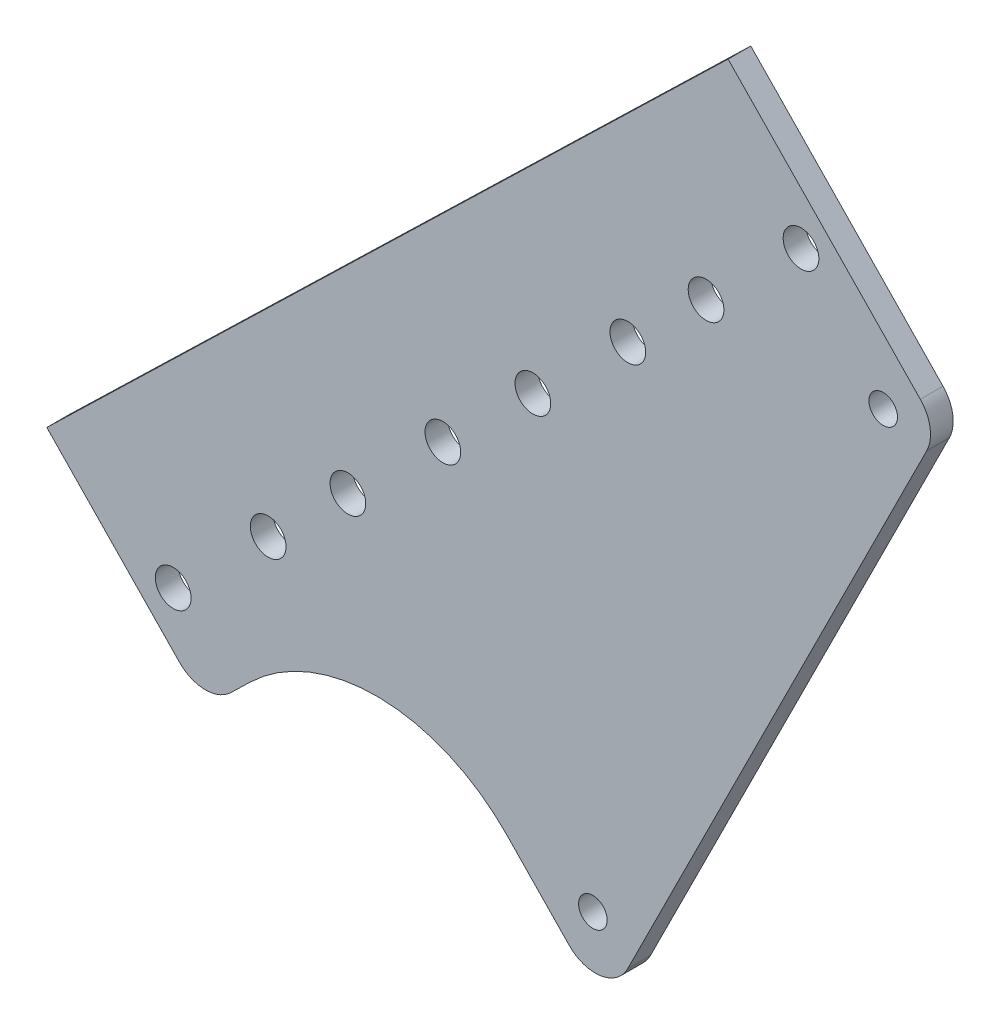
ISO-10303-21;
HEADER;
FILE_DESCRIPTION(('STEP AP214'),'2;1');
FILE_NAME('part.step','',(''),(''),'','','');
FILE_SCHEMA(('AUTOMOTIVE_DESIGN { 1 0 10303 214 1 1 1 1 }'));
ENDSEC;
DATA;
#1=APPLICATION_CONTEXT('core data for automotive mechanical design processes');
#2=APPLICATION_PROTOCOL_DEFINITION('international standard','automotive_design',2000,#1);
#3=PRODUCT_CONTEXT('',#1,'mechanical');
#4=PRODUCT('Part','Part','',(#3));
#5=PRODUCT_RELATED_PRODUCT_CATEGORY('part','',(#4));
#6=PRODUCT_DEFINITION_FORMATION('','',#4);
#7=PRODUCT_DEFINITION_CONTEXT('part definition',#1,'design');
#8=PRODUCT_DEFINITION('design','',#6,#7);
#9=PRODUCT_DEFINITION_SHAPE('','',#8);
#10=(LENGTH_UNIT() NAMED_UNIT(*) SI_UNIT(.MILLI.,.METRE.));
#11=(NAMED_UNIT(*) PLANE_ANGLE_UNIT() SI_UNIT($,.RADIAN.));
#12=(NAMED_UNIT(*) SI_UNIT($,.STERADIAN.) SOLID_ANGLE_UNIT());
#13=UNCERTAINTY_MEASURE_WITH_UNIT(LENGTH_MEASURE(1.E-05),#10,'distance_accuracy_value','');
#14=(GEOMETRIC_REPRESENTATION_CONTEXT(3) GLOBAL_UNCERTAINTY_ASSIGNED_CONTEXT((#13)) GLOBAL_UNIT_ASSIGNED_CONTEXT((#10,
#11,#12)) REPRESENTATION_CONTEXT('',''));
#15=CARTESIAN_POINT('',(0.,0.,0.));
#16=DIRECTION('',(0.,0.,1.));
#17=DIRECTION('',(1.,0.,0.));
#18=AXIS2_PLACEMENT_3D('',#15,#16,#17);
#19=CARTESIAN_POINT('',(-43.0883873371505,21.5441936685753,3.175));
#20=DIRECTION('',(0.894427190999916,-0.447213595499958,0.));
#21=DIRECTION('',(0.447213595499958,0.894427190999916,0.));
#22=AXIS2_PLACEMENT_3D('',#19,#20,#21);
#23=PLANE('',#22);
#24=DIRECTION('',(-0.447213595499958,-0.894427190999916,0.));
#25=VECTOR('',#24,1.);
#26=CARTESIAN_POINT('',(-43.0883873371505,21.5441936685753,0.));
#27=LINE('',#26,#25);
#28=CARTESIAN_POINT('',(-14.2379406923614,79.2450869581535,0.));
#29=VERTEX_POINT('',#28);
#30=CARTESIAN_POINT('',(-56.0819345836657,-4.44290082445517,0.));
#31=VERTEX_POINT('',#30);
#32=EDGE_CURVE('E196',#29,#31,#27,.T.);
#33=ORIENTED_EDGE('',*,*,#32,.F.);
#34=DIRECTION('',(0.,0.,-1.));
#35=VECTOR('',#34,1.);
#36=CARTESIAN_POINT('',(-14.2379406923614,79.2450869581535,3.175));
#37=LINE('',#36,#35);
#38=CARTESIAN_POINT('',(-14.2379406923614,79.2450869581535,3.175));
#39=VERTEX_POINT('',#38);
#40=EDGE_CURVE('E213',#29,#39,#37,.F.);
#41=ORIENTED_EDGE('',*,*,#40,.T.);
#42=DIRECTION('',(-0.447213595499958,-0.894427190999916,0.));
#43=VECTOR('',#42,1.);
#44=CARTESIAN_POINT('',(-43.0883873371505,21.5441936685753,3.175));
#45=LINE('',#44,#43);
#46=CARTESIAN_POINT('',(-56.0819345836657,-4.44290082445517,3.175));
#47=VERTEX_POINT('',#46);
#48=EDGE_CURVE('E181',#39,#47,#45,.T.);
#49=ORIENTED_EDGE('',*,*,#48,.T.);
#50=DIRECTION('',(0.,0.,-1.));
#51=VECTOR('',#50,1.);
#52=CARTESIAN_POINT('',(-56.0819345836657,-4.44290082445517,0.));
#53=LINE('',#52,#51);
#54=EDGE_CURVE('E210',#47,#31,#53,.T.);
#55=ORIENTED_EDGE('',*,*,#54,.T.);
#56=EDGE_LOOP('',(#33,#41,#49,#55));
#57=FACE_BOUND('',#56,.T.);
#58=ADVANCED_FACE('F39',(#57),#23,.T.);
#59=CARTESIAN_POINT('',(34.6932664146584,33.59227819075,3.175));
#60=DIRECTION('',(0.718414301247998,0.695615476942794,0.));
#61=DIRECTION('',(-0.695615476942794,0.718414301247998,0.));
#62=AXIS2_PLACEMENT_3D('',#59,#60,#61);
#63=PLANE('',#62);
#64=DIRECTION('',(0.695615476942794,-0.718414301247998,0.));
#65=VECTOR('',#64,1.);
#66=CARTESIAN_POINT('',(34.6932664146584,33.59227819075,3.175));
#67=LINE('',#66,#65);
#68=CARTESIAN_POINT('',(-42.0319292043812,112.832145079596,3.175));
#69=VERTEX_POINT('',#68);
#70=CARTESIAN_POINT('',(-15.1320861723012,85.0506586461627,3.175));
#71=VERTEX_POINT('',#70);
#72=EDGE_CURVE('E184',#69,#71,#67,.T.);
#73=ORIENTED_EDGE('',*,*,#72,.T.);
#74=DIRECTION('',(0.,0.,-1.));
#75=VECTOR('',#74,1.);
#76=CARTESIAN_POINT('',(-15.1320861723012,85.0506586461627,3.175));
#77=LINE('',#76,#75);
#78=CARTESIAN_POINT('',(-15.1320861723012,85.0506586461627,0.));
#79=VERTEX_POINT('',#78);
#80=EDGE_CURVE('E202',#71,#79,#77,.T.);
#81=ORIENTED_EDGE('',*,*,#80,.T.);
#82=DIRECTION('',(0.695615476942794,-0.718414301247998,0.));
#83=VECTOR('',#82,1.);
#84=CARTESIAN_POINT('',(34.6932664146584,33.59227819075,0.));
#85=LINE('',#84,#83);
#86=CARTESIAN_POINT('',(-42.0319292043812,112.832145079596,0.));
#87=VERTEX_POINT('',#86);
#88=EDGE_CURVE('E129',#87,#79,#85,.T.);
#89=ORIENTED_EDGE('',*,*,#88,.F.);
#90=DIRECTION('',(0.,0.,-1.));
#91=VECTOR('',#90,1.);
#92=CARTESIAN_POINT('',(-42.0319292043812,112.832145079596,3.175));
#93=LINE('',#92,#91);
#94=EDGE_CURVE('E127',#69,#87,#93,.T.);
#95=ORIENTED_EDGE('',*,*,#94,.F.);
#96=EDGE_LOOP('',(#73,#81,#89,#95));
#97=FACE_BOUND('',#96,.T.);
#98=ADVANCED_FACE('F296',(#97),#63,.T.);
#99=CARTESIAN_POINT('',(-76.7251956190396,79.2398668888462,3.175));
#100=DIRECTION('',(0.695615476942794,-0.718414301247998,0.));
#101=DIRECTION('',(0.718414301247998,0.695615476942794,0.));
#102=AXIS2_PLACEMENT_3D('',#99,#100,#101);
#103=PLANE('',#102);
#104=DIRECTION('',(-0.718414301247998,-0.695615476942794,0.));
#105=VECTOR('',#104,1.);
#106=CARTESIAN_POINT('',(-76.7251956190396,79.2398668888462,0.));
#107=LINE('',#106,#105);
#108=CARTESIAN_POINT('',(-137.384173659925,20.5058969950491,0.));
#109=VERTEX_POINT('',#108);
#110=EDGE_CURVE('E116',#87,#109,#107,.T.);
#111=ORIENTED_EDGE('',*,*,#110,.T.);
#112=DIRECTION('',(0.,0.,-1.));
#113=VECTOR('',#112,1.);
#114=CARTESIAN_POINT('',(-137.384173659925,20.5058969950491,69.2064304654857));
#115=LINE('',#114,#113);
#116=CARTESIAN_POINT('',(-137.384173659925,20.5058969950491,3.175));
#117=VERTEX_POINT('',#116);
#118=EDGE_CURVE('E126',#117,#109,#115,.T.);
#119=ORIENTED_EDGE('',*,*,#118,.F.);
#120=DIRECTION('',(-0.718414301247998,-0.695615476942794,0.));
#121=VECTOR('',#120,1.);
#122=CARTESIAN_POINT('',(-76.7251956190396,79.2398668888462,3.175));
#123=LINE('',#122,#121);
#124=EDGE_CURVE('E187',#69,#117,#123,.T.);
#125=ORIENTED_EDGE('',*,*,#124,.F.);
#126=ORIENTED_EDGE('',*,*,#94,.T.);
#127=EDGE_LOOP('',(#111,#119,#125,#126));
#128=FACE_BOUND('',#127,.T.);
#129=ADVANCED_FACE('F124',(#128),#103,.F.);
#130=CARTESIAN_POINT('',(-60.96,0.,3.175));
#131=DIRECTION('',(0.,0.,-1.));
#132=DIRECTION('',(-1.,0.,0.));
#133=AXIS2_PLACEMENT_3D('',#130,#131,#132);
#134=CYLINDRICAL_SURFACE('',#133,2.);
#135=CARTESIAN_POINT('',(-60.96,0.,3.175));
#136=DIRECTION('',(0.,0.,1.));
#137=DIRECTION('',(1.,0.,0.));
#138=AXIS2_PLACEMENT_3D('',#135,#136,#137);
#139=CIRCLE('',#138,2.);
#140=CARTESIAN_POINT('',(-58.96,0.,3.175));
#141=VERTEX_POINT('',#140);
#142=EDGE_CURVE('E178',#141,#141,#139,.T.);
#143=ORIENTED_EDGE('',*,*,#142,.T.);
#144=EDGE_LOOP('',(#143));
#145=FACE_BOUND('',#144,.T.);
#146=CARTESIAN_POINT('',(-60.96,0.,0.));
#147=DIRECTION('',(0.,0.,1.));
#148=DIRECTION('',(1.,0.,0.));
#149=AXIS2_PLACEMENT_3D('',#146,#147,#148);
#150=CIRCLE('',#149,2.);
#151=CARTESIAN_POINT('',(-58.96,0.,0.));
#152=VERTEX_POINT('',#151);
#153=EDGE_CURVE('E193',#152,#152,#150,.T.);
#154=ORIENTED_EDGE('',*,*,#153,.F.);
#155=EDGE_LOOP('',(#154));
#156=FACE_BOUND('',#155,.T.);
#157=ADVANCED_FACE('F284',(#145,#156),#134,.F.);
#158=CARTESIAN_POINT('',(-20.32,81.28,3.175));
#159=DIRECTION('',(0.,0.,-1.));
#160=DIRECTION('',(-1.,0.,0.));
#161=AXIS2_PLACEMENT_3D('',#158,#159,#160);
#162=CYLINDRICAL_SURFACE('',#161,2.);
#163=CARTESIAN_POINT('',(-20.32,81.28,3.175));
#164=DIRECTION('',(0.,0.,1.));
#165=DIRECTION('',(1.,0.,0.));
#166=AXIS2_PLACEMENT_3D('',#163,#164,#165);
#167=CIRCLE('',#166,2.);
#168=CARTESIAN_POINT('',(-18.32,81.28,3.175));
#169=VERTEX_POINT('',#168);
#170=EDGE_CURVE('E175',#169,#169,#167,.T.);
#171=ORIENTED_EDGE('',*,*,#170,.T.);
#172=EDGE_LOOP('',(#171));
#173=FACE_BOUND('',#172,.T.);
#174=CARTESIAN_POINT('',(-20.32,81.28,0.));
#175=DIRECTION('',(0.,0.,1.));
#176=DIRECTION('',(1.,0.,0.));
#177=AXIS2_PLACEMENT_3D('',#174,#175,#176);
#178=CIRCLE('',#177,2.);
#179=CARTESIAN_POINT('',(-18.32,81.28,0.));
#180=VERTEX_POINT('',#179);
#181=EDGE_CURVE('E145',#180,#180,#178,.T.);
#182=ORIENTED_EDGE('',*,*,#181,.F.);
#183=EDGE_LOOP('',(#182));
#184=FACE_BOUND('',#183,.T.);
#185=ADVANCED_FACE('F286',(#173,#184),#162,.F.);
#186=CARTESIAN_POINT('',(-36.0245516510919,-34.8813151894287,3.175));
#187=DIRECTION('',(0.718414301247998,0.695615476942794,0.));
#188=DIRECTION('',(-0.695615476942794,0.718414301247998,0.));
#189=AXIS2_PLACEMENT_3D('',#186,#187,#188);
#190=PLANE('',#189);
#191=DIRECTION('',(0.695615476942794,-0.718414301247998,0.));
#192=VECTOR('',#191,1.);
#193=CARTESIAN_POINT('',(-36.0245516510919,-34.8813151894287,3.175));
#194=LINE('',#193,#192);
#195=CARTESIAN_POINT('',(-72.9953227628507,3.3011743830944,3.175));
#196=VERTEX_POINT('',#195);
#197=CARTESIAN_POINT('',(-64.2751693642851,-5.70478238218476,3.175));
#198=VERTEX_POINT('',#197);
#199=EDGE_CURVE('E189',#196,#198,#194,.T.);
#200=ORIENTED_EDGE('',*,*,#199,.F.);
#201=DIRECTION('',(0.,0.,-1.));
#202=VECTOR('',#201,1.);
#203=CARTESIAN_POINT('',(-72.9953227628507,3.30117438309439,3.175));
#204=LINE('',#203,#202);
#205=CARTESIAN_POINT('',(-72.9953227628507,3.3011743830944,0.));
#206=VERTEX_POINT('',#205);
#207=EDGE_CURVE('E222',#196,#206,#204,.T.);
#208=ORIENTED_EDGE('',*,*,#207,.T.);
#209=DIRECTION('',(0.695615476942794,-0.718414301247998,0.));
#210=VECTOR('',#209,1.);
#211=CARTESIAN_POINT('',(-36.0245516510919,-34.8813151894287,0.));
#212=LINE('',#211,#210);
#213=CARTESIAN_POINT('',(-64.2751693642851,-5.70478238218476,0.));
#214=VERTEX_POINT('',#213);
#215=EDGE_CURVE('E128',#206,#214,#212,.T.);
#216=ORIENTED_EDGE('',*,*,#215,.T.);
#217=DIRECTION('',(0.,0.,-1.));
#218=VECTOR('',#217,1.);
#219=CARTESIAN_POINT('',(-64.2751693642851,-5.70478238218477,3.175));
#220=LINE('',#219,#218);
#221=EDGE_CURVE('E219',#214,#198,#220,.F.);
#222=ORIENTED_EDGE('',*,*,#221,.T.);
#223=EDGE_LOOP('',(#200,#208,#216,#222));
#224=FACE_BOUND('',#223,.T.);
#225=ADVANCED_FACE('F293',(#224),#190,.F.);
#226=CARTESIAN_POINT('',(0.,0.,3.175));
#227=DIRECTION('',(0.,0.,1.));
#228=DIRECTION('',(1.,0.,0.));
#229=AXIS2_PLACEMENT_3D('',#226,#227,#228);
#230=PLANE('',#229);
#231=CARTESIAN_POINT('',(-106.40482690328,22.7743833916435,3.175));
#232=DIRECTION('',(0.,0.,-1.));
#233=DIRECTION('',(-1.,0.,0.));
#234=AXIS2_PLACEMENT_3D('',#231,#232,#233);
#235=CIRCLE('',#234,2.50000000000001);
#236=CARTESIAN_POINT('',(-108.90482690328,22.7743833916435,3.175));
#237=VERTEX_POINT('',#236);
#238=EDGE_CURVE('E244',#237,#237,#235,.T.);
#239=ORIENTED_EDGE('',*,*,#238,.T.);
#240=EDGE_LOOP('',(#239));
#241=FACE_BOUND('',#240,.T.);
#242=CARTESIAN_POINT('',(-119.695491476368,9.9054970682018,3.175));
#243=DIRECTION('',(0.,0.,-1.));
#244=DIRECTION('',(-1.,0.,0.));
#245=AXIS2_PLACEMENT_3D('',#242,#243,#244);
#246=CIRCLE('',#245,2.49999999999999);
#247=CARTESIAN_POINT('',(-122.195491476368,9.9054970682018,3.175));
#248=VERTEX_POINT('',#247);
#249=EDGE_CURVE('E250',#248,#248,#246,.T.);
#250=ORIENTED_EDGE('',*,*,#249,.T.);
#251=EDGE_LOOP('',(#250));
#252=FACE_BOUND('',#251,.T.);
#253=CARTESIAN_POINT('',(-95.2435423190912,33.5814654414267,3.175));
#254=DIRECTION('',(0.,0.,-1.));
#255=DIRECTION('',(-1.,0.,0.));
#256=AXIS2_PLACEMENT_3D('',#253,#254,#255);
#257=CIRCLE('',#256,2.5);
#258=CARTESIAN_POINT('',(-97.7435423190912,33.5814654414267,3.175));
#259=VERTEX_POINT('',#258);
#260=EDGE_CURVE('E142',#259,#259,#257,.T.);
#261=ORIENTED_EDGE('',*,*,#260,.T.);
#262=EDGE_LOOP('',(#261));
#263=FACE_BOUND('',#262,.T.);
#264=CARTESIAN_POINT('',(-69.354776651216,58.6486530603751,3.175));
#265=DIRECTION('',(0.,0.,-1.));
#266=DIRECTION('',(-1.,0.,0.));
#267=AXIS2_PLACEMENT_3D('',#264,#265,#266);
#268=CIRCLE('',#267,2.50000000000001);
#269=CARTESIAN_POINT('',(-71.854776651216,58.6486530603751,3.175));
#270=VERTEX_POINT('',#269);
#271=EDGE_CURVE('E134',#270,#270,#268,.T.);
#272=ORIENTED_EDGE('',*,*,#271,.T.);
#273=EDGE_LOOP('',(#272));
#274=FACE_BOUND('',#273,.T.);
#275=CARTESIAN_POINT('',(-31.8248135540206,94.9876055758667,3.175));
#276=DIRECTION('',(0.,0.,-1.));
#277=DIRECTION('',(-1.,0.,0.));
#278=AXIS2_PLACEMENT_3D('',#275,#276,#277);
#279=CIRCLE('',#278,2.5);
#280=CARTESIAN_POINT('',(-34.3248135540206,94.9876055758667,3.175));
#281=VERTEX_POINT('',#280);
#282=EDGE_CURVE('E167',#281,#281,#279,.T.);
#283=ORIENTED_EDGE('',*,*,#282,.T.);
#284=EDGE_LOOP('',(#283));
#285=FACE_BOUND('',#284,.T.);
#286=CARTESIAN_POINT('',(-81.9528777460032,46.4503517648684,3.175));
#287=DIRECTION('',(0.,0.,-1.));
#288=DIRECTION('',(-1.,0.,0.));
#289=AXIS2_PLACEMENT_3D('',#286,#287,#288);
#290=CIRCLE('',#289,2.50000000000269);
#291=CARTESIAN_POINT('',(-84.4528777460059,46.4503517648684,3.175));
#292=VERTEX_POINT('',#291);
#293=EDGE_CURVE('E156',#292,#292,#290,.T.);
#294=ORIENTED_EDGE('',*,*,#293,.T.);
#295=EDGE_LOOP('',(#294));
#296=FACE_BOUND('',#295,.T.);
#297=CARTESIAN_POINT('',(-45.1154781271085,82.118719252425,3.175));
#298=DIRECTION('',(0.,0.,-1.));
#299=DIRECTION('',(-1.,0.,0.));
#300=AXIS2_PLACEMENT_3D('',#297,#298,#299);
#301=CIRCLE('',#300,2.5000000000027);
#302=CARTESIAN_POINT('',(-47.6154781271112,82.118719252425,3.175));
#303=VERTEX_POINT('',#302);
#304=EDGE_CURVE('E157',#303,#303,#301,.T.);
#305=ORIENTED_EDGE('',*,*,#304,.T.);
#306=EDGE_LOOP('',(#305));
#307=FACE_BOUND('',#306,.T.);
#308=CARTESIAN_POINT('',(-56.064112078128,71.5175393838168,3.175));
#309=DIRECTION('',(0.,0.,-1.));
#310=DIRECTION('',(-1.,0.,0.));
#311=AXIS2_PLACEMENT_3D('',#308,#309,#310);
#312=CIRCLE('',#311,2.5000000000027);
#313=CARTESIAN_POINT('',(-58.5641120781307,71.5175393838168,3.175));
#314=VERTEX_POINT('',#313);
#315=EDGE_CURVE('E151',#314,#314,#312,.T.);
#316=ORIENTED_EDGE('',*,*,#315,.T.);
#317=EDGE_LOOP('',(#316));
#318=FACE_BOUND('',#317,.T.);
#319=ORIENTED_EDGE('',*,*,#170,.F.);
#320=EDGE_LOOP('',(#319));
#321=FACE_BOUND('',#320,.T.);
#322=ORIENTED_EDGE('',*,*,#142,.F.);
#323=EDGE_LOOP('',(#322));
#324=FACE_BOUND('',#323,.T.);
#325=DIRECTION('',(-0.695615476942794,0.718414301247998,0.));
#326=VECTOR('',#325,1.);
#327=CARTESIAN_POINT('',(-137.384173659925,20.5058969950491,3.175));
#328=LINE('',#327,#326);
#329=CARTESIAN_POINT('',(-118.832108889861,1.34578758076497,3.175));
#330=VERTEX_POINT('',#329);
#331=EDGE_CURVE('E132',#330,#117,#328,.T.);
#332=ORIENTED_EDGE('',*,*,#331,.F.);
#333=CARTESIAN_POINT('',(-115.182564239521,4.87951420363437,3.175));
#334=DIRECTION('',(0.,0.,1.));
#335=DIRECTION('',(1.,0.,0.));
#336=AXIS2_PLACEMENT_3D('',#333,#334,#335);
#337=CIRCLE('',#336,5.08);
#338=CARTESIAN_POINT('',(-111.648837616652,1.22996955329454,3.175));
#339=VERTEX_POINT('',#338);
#340=EDGE_CURVE('E11',#330,#339,#337,.T.);
#341=ORIENTED_EDGE('',*,*,#340,.T.);
#342=DIRECTION('',(-0.718414301247998,-0.695615476942794,0.));
#343=VECTOR('',#342,1.);
#344=CARTESIAN_POINT('',(-115.298382266992,-2.30375706957486,3.175));
#345=LINE('',#344,#343);
#346=CARTESIAN_POINT('',(-108.911679128897,3.88026452044659,3.175));
#347=VERTEX_POINT('',#346);
#348=EDGE_CURVE('E119',#347,#339,#345,.T.);
#349=ORIENTED_EDGE('',*,*,#348,.F.);
#350=CARTESIAN_POINT('',(-91.2430460145499,-14.3674587312526,3.175));
#351=DIRECTION('',(0.,0.,1.));
#352=DIRECTION('',(1.,0.,0.));
#353=AXIS2_PLACEMENT_3D('',#350,#351,#352);
#354=CIRCLE('',#353,25.4);
#355=EDGE_CURVE('E229',#347,#196,#354,.F.);
#356=ORIENTED_EDGE('',*,*,#355,.T.);
#357=ORIENTED_EDGE('',*,*,#199,.T.);
#358=CARTESIAN_POINT('',(-60.6256247139453,-2.17105575931538,3.175));
#359=DIRECTION('',(0.,0.,1.));
#360=DIRECTION('',(1.,0.,0.));
#361=AXIS2_PLACEMENT_3D('',#358,#359,#360);
#362=CIRCLE('',#361,5.08);
#363=EDGE_CURVE('E215',#198,#47,#362,.T.);
#364=ORIENTED_EDGE('',*,*,#363,.T.);
#365=ORIENTED_EDGE('',*,*,#48,.F.);
#366=CARTESIAN_POINT('',(-18.781630822641,81.5169320232933,3.175));
#367=DIRECTION('',(0.,0.,1.));
#368=DIRECTION('',(1.,0.,0.));
#369=AXIS2_PLACEMENT_3D('',#366,#367,#368);
#370=CIRCLE('',#369,5.08);
#371=EDGE_CURVE('E217',#39,#71,#370,.T.);
#372=ORIENTED_EDGE('',*,*,#371,.T.);
#373=ORIENTED_EDGE('',*,*,#72,.F.);
#374=ORIENTED_EDGE('',*,*,#124,.T.);
#375=EDGE_LOOP('',(#332,#341,#349,#356,#357,#364,#365,#372,#373,#374));
#376=FACE_BOUND('',#375,.T.);
#377=ADVANCED_FACE('F264',(#241,#252,#263,#274,#285,#296,#307,#318,#321,#324,#376),#230,.T.);
#378=CARTESIAN_POINT('',(0.,0.,0.));
#379=DIRECTION('',(0.,0.,1.));
#380=DIRECTION('',(1.,0.,0.));
#381=AXIS2_PLACEMENT_3D('',#378,#379,#380);
#382=PLANE('',#381);
#383=CARTESIAN_POINT('',(-106.40482690328,22.7743833916435,0.));
#384=DIRECTION('',(0.,0.,-1.));
#385=DIRECTION('',(-1.,0.,0.));
#386=AXIS2_PLACEMENT_3D('',#383,#384,#385);
#387=CIRCLE('',#386,2.50000000000001);
#388=CARTESIAN_POINT('',(-108.90482690328,22.7743833916435,0.));
#389=VERTEX_POINT('',#388);
#390=EDGE_CURVE('E247',#389,#389,#387,.T.);
#391=ORIENTED_EDGE('',*,*,#390,.F.);
#392=EDGE_LOOP('',(#391));
#393=FACE_BOUND('',#392,.T.);
#394=CARTESIAN_POINT('',(-119.695491476368,9.9054970682018,0.));
#395=DIRECTION('',(0.,0.,-1.));
#396=DIRECTION('',(-1.,0.,0.));
#397=AXIS2_PLACEMENT_3D('',#394,#395,#396);
#398=CIRCLE('',#397,2.49999999999999);
#399=CARTESIAN_POINT('',(-122.195491476368,9.9054970682018,0.));
#400=VERTEX_POINT('',#399);
#401=EDGE_CURVE('E253',#400,#400,#398,.T.);
#402=ORIENTED_EDGE('',*,*,#401,.F.);
#403=EDGE_LOOP('',(#402));
#404=FACE_BOUND('',#403,.T.);
#405=CARTESIAN_POINT('',(-95.2435423190912,33.5814654414267,0.));
#406=DIRECTION('',(0.,0.,-1.));
#407=DIRECTION('',(-1.,0.,0.));
#408=AXIS2_PLACEMENT_3D('',#405,#406,#407);
#409=CIRCLE('',#408,2.5);
#410=CARTESIAN_POINT('',(-97.7435423190912,33.5814654414267,0.));
#411=VERTEX_POINT('',#410);
#412=EDGE_CURVE('E146',#411,#411,#409,.T.);
#413=ORIENTED_EDGE('',*,*,#412,.F.);
#414=EDGE_LOOP('',(#413));
#415=FACE_BOUND('',#414,.T.);
#416=CARTESIAN_POINT('',(-69.354776651216,58.6486530603751,0.));
#417=DIRECTION('',(0.,0.,-1.));
#418=DIRECTION('',(-1.,0.,0.));
#419=AXIS2_PLACEMENT_3D('',#416,#417,#418);
#420=CIRCLE('',#419,2.50000000000001);
#421=CARTESIAN_POINT('',(-71.854776651216,58.6486530603751,0.));
#422=VERTEX_POINT('',#421);
#423=EDGE_CURVE('E137',#422,#422,#420,.T.);
#424=ORIENTED_EDGE('',*,*,#423,.F.);
#425=EDGE_LOOP('',(#424));
#426=FACE_BOUND('',#425,.T.);
#427=CARTESIAN_POINT('',(-31.8248135540206,94.9876055758667,0.));
#428=DIRECTION('',(0.,0.,-1.));
#429=DIRECTION('',(-1.,0.,0.));
#430=AXIS2_PLACEMENT_3D('',#427,#428,#429);
#431=CIRCLE('',#430,2.5);
#432=CARTESIAN_POINT('',(-34.3248135540206,94.9876055758667,0.));
#433=VERTEX_POINT('',#432);
#434=EDGE_CURVE('E149',#433,#433,#431,.T.);
#435=ORIENTED_EDGE('',*,*,#434,.F.);
#436=EDGE_LOOP('',(#435));
#437=FACE_BOUND('',#436,.T.);
#438=CARTESIAN_POINT('',(-81.9528777460032,46.4503517648684,0.));
#439=DIRECTION('',(0.,0.,-1.));
#440=DIRECTION('',(-1.,0.,0.));
#441=AXIS2_PLACEMENT_3D('',#438,#439,#440);
#442=CIRCLE('',#441,2.50000000000269);
#443=CARTESIAN_POINT('',(-84.4528777460059,46.4503517648684,0.));
#444=VERTEX_POINT('',#443);
#445=EDGE_CURVE('E170',#444,#444,#442,.T.);
#446=ORIENTED_EDGE('',*,*,#445,.F.);
#447=EDGE_LOOP('',(#446));
#448=FACE_BOUND('',#447,.T.);
#449=CARTESIAN_POINT('',(-45.1154781271085,82.118719252425,0.));
#450=DIRECTION('',(0.,0.,-1.));
#451=DIRECTION('',(-1.,0.,0.));
#452=AXIS2_PLACEMENT_3D('',#449,#450,#451);
#453=CIRCLE('',#452,2.5000000000027);
#454=CARTESIAN_POINT('',(-47.6154781271112,82.118719252425,0.));
#455=VERTEX_POINT('',#454);
#456=EDGE_CURVE('E153',#455,#455,#453,.T.);
#457=ORIENTED_EDGE('',*,*,#456,.F.);
#458=EDGE_LOOP('',(#457));
#459=FACE_BOUND('',#458,.T.);
#460=CARTESIAN_POINT('',(-56.064112078128,71.5175393838168,0.));
#461=DIRECTION('',(0.,0.,-1.));
#462=DIRECTION('',(-1.,0.,0.));
#463=AXIS2_PLACEMENT_3D('',#460,#461,#462);
#464=CIRCLE('',#463,2.5000000000027);
#465=CARTESIAN_POINT('',(-58.5641120781307,71.5175393838168,0.));
#466=VERTEX_POINT('',#465);
#467=EDGE_CURVE('E160',#466,#466,#464,.T.);
#468=ORIENTED_EDGE('',*,*,#467,.F.);
#469=EDGE_LOOP('',(#468));
#470=FACE_BOUND('',#469,.T.);
#471=ORIENTED_EDGE('',*,*,#181,.T.);
#472=EDGE_LOOP('',(#471));
#473=FACE_BOUND('',#472,.T.);
#474=ORIENTED_EDGE('',*,*,#153,.T.);
#475=EDGE_LOOP('',(#474));
#476=FACE_BOUND('',#475,.T.);
#477=DIRECTION('',(-0.718414301247998,-0.695615476942794,0.));
#478=VECTOR('',#477,1.);
#479=CARTESIAN_POINT('',(-115.298382266992,-2.30375706957486,0.));
#480=LINE('',#479,#478);
#481=CARTESIAN_POINT('',(-108.911679128897,3.88026452044659,0.));
#482=VERTEX_POINT('',#481);
#483=CARTESIAN_POINT('',(-111.648837616652,1.22996955329454,0.));
#484=VERTEX_POINT('',#483);
#485=EDGE_CURVE('E120',#482,#484,#480,.T.);
#486=ORIENTED_EDGE('',*,*,#485,.T.);
#487=CARTESIAN_POINT('',(-115.182564239521,4.87951420363437,0.));
#488=DIRECTION('',(0.,0.,1.));
#489=DIRECTION('',(1.,0.,0.));
#490=AXIS2_PLACEMENT_3D('',#487,#488,#489);
#491=CIRCLE('',#490,5.08);
#492=CARTESIAN_POINT('',(-118.832108889861,1.34578758076497,0.));
#493=VERTEX_POINT('',#492);
#494=EDGE_CURVE('E61',#484,#493,#491,.F.);
#495=ORIENTED_EDGE('',*,*,#494,.T.);
#496=DIRECTION('',(-0.695615476942794,0.718414301247998,0.));
#497=VECTOR('',#496,1.);
#498=CARTESIAN_POINT('',(-137.384173659925,20.5058969950491,0.));
#499=LINE('',#498,#497);
#500=EDGE_CURVE('E112',#493,#109,#499,.T.);
#501=ORIENTED_EDGE('',*,*,#500,.T.);
#502=ORIENTED_EDGE('',*,*,#110,.F.);
#503=ORIENTED_EDGE('',*,*,#88,.T.);
#504=CARTESIAN_POINT('',(-18.781630822641,81.5169320232933,0.));
#505=DIRECTION('',(0.,0.,1.));
#506=DIRECTION('',(1.,0.,0.));
#507=AXIS2_PLACEMENT_3D('',#504,#505,#506);
#508=CIRCLE('',#507,5.08);
#509=EDGE_CURVE('E208',#79,#29,#508,.F.);
#510=ORIENTED_EDGE('',*,*,#509,.T.);
#511=ORIENTED_EDGE('',*,*,#32,.T.);
#512=CARTESIAN_POINT('',(-60.6256247139453,-2.17105575931538,0.));
#513=DIRECTION('',(0.,0.,1.));
#514=DIRECTION('',(1.,0.,0.));
#515=AXIS2_PLACEMENT_3D('',#512,#513,#514);
#516=CIRCLE('',#515,5.08);
#517=EDGE_CURVE('E205',#31,#214,#516,.F.);
#518=ORIENTED_EDGE('',*,*,#517,.T.);
#519=ORIENTED_EDGE('',*,*,#215,.F.);
#520=CARTESIAN_POINT('',(-91.2430460145499,-14.3674587312526,0.));
#521=DIRECTION('',(0.,0.,1.));
#522=DIRECTION('',(1.,0.,0.));
#523=AXIS2_PLACEMENT_3D('',#520,#521,#522);
#524=CIRCLE('',#523,25.4);
#525=EDGE_CURVE('E227',#206,#482,#524,.T.);
#526=ORIENTED_EDGE('',*,*,#525,.T.);
#527=EDGE_LOOP('',(#486,#495,#501,#502,#503,#510,#511,#518,#519,#526));
#528=FACE_BOUND('',#527,.T.);
#529=ADVANCED_FACE('F114',(#393,#404,#415,#426,#437,#448,#459,#470,#473,#476,#528),#382,.F.);
#530=CARTESIAN_POINT('',(-56.064112078128,71.5175393838168,3.175));
#531=DIRECTION('',(0.,0.,-1.));
#532=DIRECTION('',(-1.,0.,0.));
#533=AXIS2_PLACEMENT_3D('',#530,#531,#532);
#534=CYLINDRICAL_SURFACE('',#533,2.5000000000027);
#535=ORIENTED_EDGE('',*,*,#315,.F.);
#536=EDGE_LOOP('',(#535));
#537=FACE_BOUND('',#536,.T.);
#538=ORIENTED_EDGE('',*,*,#467,.T.);
#539=EDGE_LOOP('',(#538));
#540=FACE_BOUND('',#539,.T.);
#541=ADVANCED_FACE('F263',(#537,#540),#534,.F.);
#542=CARTESIAN_POINT('',(-45.1154781271085,82.118719252425,3.175));
#543=DIRECTION('',(0.,0.,-1.));
#544=DIRECTION('',(-1.,0.,0.));
#545=AXIS2_PLACEMENT_3D('',#542,#543,#544);
#546=CYLINDRICAL_SURFACE('',#545,2.5000000000027);
#547=ORIENTED_EDGE('',*,*,#304,.F.);
#548=EDGE_LOOP('',(#547));
#549=FACE_BOUND('',#548,.T.);
#550=ORIENTED_EDGE('',*,*,#456,.T.);
#551=EDGE_LOOP('',(#550));
#552=FACE_BOUND('',#551,.T.);
#553=ADVANCED_FACE('F318',(#549,#552),#546,.F.);
#554=CARTESIAN_POINT('',(-81.9528777460032,46.4503517648684,3.175));
#555=DIRECTION('',(0.,0.,-1.));
#556=DIRECTION('',(-1.,0.,0.));
#557=AXIS2_PLACEMENT_3D('',#554,#555,#556);
#558=CYLINDRICAL_SURFACE('',#557,2.50000000000269);
#559=ORIENTED_EDGE('',*,*,#293,.F.);
#560=EDGE_LOOP('',(#559));
#561=FACE_BOUND('',#560,.T.);
#562=ORIENTED_EDGE('',*,*,#445,.T.);
#563=EDGE_LOOP('',(#562));
#564=FACE_BOUND('',#563,.T.);
#565=ADVANCED_FACE('F314',(#561,#564),#558,.F.);
#566=CARTESIAN_POINT('',(-31.8248135540206,94.9876055758667,3.175));
#567=DIRECTION('',(0.,0.,-1.));
#568=DIRECTION('',(-1.,0.,0.));
#569=AXIS2_PLACEMENT_3D('',#566,#567,#568);
#570=CYLINDRICAL_SURFACE('',#569,2.5);
#571=ORIENTED_EDGE('',*,*,#282,.F.);
#572=EDGE_LOOP('',(#571));
#573=FACE_BOUND('',#572,.T.);
#574=ORIENTED_EDGE('',*,*,#434,.T.);
#575=EDGE_LOOP('',(#574));
#576=FACE_BOUND('',#575,.T.);
#577=ADVANCED_FACE('F317',(#573,#576),#570,.F.);
#578=CARTESIAN_POINT('',(-69.354776651216,58.6486530603751,3.175));
#579=DIRECTION('',(0.,0.,-1.));
#580=DIRECTION('',(-1.,0.,0.));
#581=AXIS2_PLACEMENT_3D('',#578,#579,#580);
#582=CYLINDRICAL_SURFACE('',#581,2.50000000000001);
#583=ORIENTED_EDGE('',*,*,#271,.F.);
#584=EDGE_LOOP('',(#583));
#585=FACE_BOUND('',#584,.T.);
#586=ORIENTED_EDGE('',*,*,#423,.T.);
#587=EDGE_LOOP('',(#586));
#588=FACE_BOUND('',#587,.T.);
#589=ADVANCED_FACE('F322',(#585,#588),#582,.F.);
#590=CARTESIAN_POINT('',(-95.2435423190912,33.5814654414267,3.175));
#591=DIRECTION('',(0.,0.,-1.));
#592=DIRECTION('',(-1.,0.,0.));
#593=AXIS2_PLACEMENT_3D('',#590,#591,#592);
#594=CYLINDRICAL_SURFACE('',#593,2.5);
#595=ORIENTED_EDGE('',*,*,#260,.F.);
#596=EDGE_LOOP('',(#595));
#597=FACE_BOUND('',#596,.T.);
#598=ORIENTED_EDGE('',*,*,#412,.T.);
#599=EDGE_LOOP('',(#598));
#600=FACE_BOUND('',#599,.T.);
#601=ADVANCED_FACE('F332',(#597,#600),#594,.F.);
#602=CARTESIAN_POINT('',(-115.298382266992,-2.30375706957486,69.2064304654857));
#603=DIRECTION('',(0.695615476942794,-0.718414301247998,0.));
#604=DIRECTION('',(0.718414301247998,0.695615476942794,0.));
#605=AXIS2_PLACEMENT_3D('',#602,#603,#604);
#606=PLANE('',#605);
#607=ORIENTED_EDGE('',*,*,#348,.T.);
#608=DIRECTION('',(0.,0.,-1.));
#609=VECTOR('',#608,1.);
#610=CARTESIAN_POINT('',(-111.648837616652,1.22996955329454,69.2064304654857));
#611=LINE('',#610,#609);
#612=EDGE_CURVE('E231',#339,#484,#611,.T.);
#613=ORIENTED_EDGE('',*,*,#612,.T.);
#614=ORIENTED_EDGE('',*,*,#485,.F.);
#615=DIRECTION('',(0.,0.,-1.));
#616=VECTOR('',#615,1.);
#617=CARTESIAN_POINT('',(-108.911679128897,3.88026452044659,69.2064304654857));
#618=LINE('',#617,#616);
#619=EDGE_CURVE('E225',#482,#347,#618,.F.);
#620=ORIENTED_EDGE('',*,*,#619,.T.);
#621=EDGE_LOOP('',(#607,#613,#614,#620));
#622=FACE_BOUND('',#621,.T.);
#623=ADVANCED_FACE('F238',(#622),#606,.T.);
#624=CARTESIAN_POINT('',(-137.384173659925,20.5058969950491,69.2064304654857));
#625=DIRECTION('',(-0.718414301247998,-0.695615476942794,0.));
#626=DIRECTION('',(0.695615476942794,-0.718414301247998,0.));
#627=AXIS2_PLACEMENT_3D('',#624,#625,#626);
#628=PLANE('',#627);
#629=ORIENTED_EDGE('',*,*,#500,.F.);
#630=DIRECTION('',(0.,0.,-1.));
#631=VECTOR('',#630,1.);
#632=CARTESIAN_POINT('',(-118.832108889861,1.34578758076497,69.2064304654857));
#633=LINE('',#632,#631);
#634=EDGE_CURVE('E47',#493,#330,#633,.F.);
#635=ORIENTED_EDGE('',*,*,#634,.T.);
#636=ORIENTED_EDGE('',*,*,#331,.T.);
#637=ORIENTED_EDGE('',*,*,#118,.T.);
#638=EDGE_LOOP('',(#629,#635,#636,#637));
#639=FACE_BOUND('',#638,.T.);
#640=ADVANCED_FACE('F131',(#639),#628,.T.);
#641=CARTESIAN_POINT('',(-119.695491476368,9.9054970682018,3.175));
#642=DIRECTION('',(0.,0.,-1.));
#643=DIRECTION('',(-1.,0.,0.));
#644=AXIS2_PLACEMENT_3D('',#641,#642,#643);
#645=CYLINDRICAL_SURFACE('',#644,2.49999999999999);
#646=ORIENTED_EDGE('',*,*,#249,.F.);
#647=EDGE_LOOP('',(#646));
#648=FACE_BOUND('',#647,.T.);
#649=ORIENTED_EDGE('',*,*,#401,.T.);
#650=EDGE_LOOP('',(#649));
#651=FACE_BOUND('',#650,.T.);
#652=ADVANCED_FACE('F341',(#648,#651),#645,.F.);
#653=CARTESIAN_POINT('',(-106.40482690328,22.7743833916435,3.175));
#654=DIRECTION('',(0.,0.,-1.));
#655=DIRECTION('',(-1.,0.,0.));
#656=AXIS2_PLACEMENT_3D('',#653,#654,#655);
#657=CYLINDRICAL_SURFACE('',#656,2.50000000000001);
#658=ORIENTED_EDGE('',*,*,#238,.F.);
#659=EDGE_LOOP('',(#658));
#660=FACE_BOUND('',#659,.T.);
#661=ORIENTED_EDGE('',*,*,#390,.T.);
#662=EDGE_LOOP('',(#661));
#663=FACE_BOUND('',#662,.T.);
#664=ADVANCED_FACE('F259',(#660,#663),#657,.F.);
#665=CARTESIAN_POINT('',(-18.781630822641,81.5169320232933,3.175));
#666=DIRECTION('',(0.,0.,-1.));
#667=DIRECTION('',(-1.,0.,0.));
#668=AXIS2_PLACEMENT_3D('',#665,#666,#667);
#669=CYLINDRICAL_SURFACE('',#668,5.08);
#670=ORIENTED_EDGE('',*,*,#371,.F.);
#671=ORIENTED_EDGE('',*,*,#40,.F.);
#672=ORIENTED_EDGE('',*,*,#509,.F.);
#673=ORIENTED_EDGE('',*,*,#80,.F.);
#674=EDGE_LOOP('',(#670,#671,#672,#673));
#675=FACE_BOUND('',#674,.T.);
#676=ADVANCED_FACE('F346',(#675),#669,.T.);
#677=CARTESIAN_POINT('',(-60.6256247139453,-2.17105575931538,3.175));
#678=DIRECTION('',(0.,0.,1.));
#679=DIRECTION('',(1.,0.,0.));
#680=AXIS2_PLACEMENT_3D('',#677,#678,#679);
#681=CYLINDRICAL_SURFACE('',#680,5.08);
#682=ORIENTED_EDGE('',*,*,#363,.F.);
#683=ORIENTED_EDGE('',*,*,#221,.F.);
#684=ORIENTED_EDGE('',*,*,#517,.F.);
#685=ORIENTED_EDGE('',*,*,#54,.F.);
#686=EDGE_LOOP('',(#682,#683,#684,#685));
#687=FACE_BOUND('',#686,.T.);
#688=ADVANCED_FACE('F351',(#687),#681,.T.);
#689=CARTESIAN_POINT('',(-91.2430460145499,-14.3674587312526,3.175));
#690=DIRECTION('',(0.,0.,-1.));
#691=DIRECTION('',(-1.,0.,0.));
#692=AXIS2_PLACEMENT_3D('',#689,#690,#691);
#693=CYLINDRICAL_SURFACE('',#692,25.4);
#694=ORIENTED_EDGE('',*,*,#355,.F.);
#695=ORIENTED_EDGE('',*,*,#619,.F.);
#696=ORIENTED_EDGE('',*,*,#525,.F.);
#697=ORIENTED_EDGE('',*,*,#207,.F.);
#698=EDGE_LOOP('',(#694,#695,#696,#697));
#699=FACE_BOUND('',#698,.T.);
#700=ADVANCED_FACE('F376',(#699),#693,.F.);
#701=CARTESIAN_POINT('',(-115.182564239521,4.87951420363437,69.2064304654857));
#702=DIRECTION('',(0.,0.,-1.));
#703=DIRECTION('',(-1.,0.,0.));
#704=AXIS2_PLACEMENT_3D('',#701,#702,#703);
#705=CYLINDRICAL_SURFACE('',#704,5.08);
#706=ORIENTED_EDGE('',*,*,#340,.F.);
#707=ORIENTED_EDGE('',*,*,#634,.F.);
#708=ORIENTED_EDGE('',*,*,#494,.F.);
#709=ORIENTED_EDGE('',*,*,#612,.F.);
#710=EDGE_LOOP('',(#706,#707,#708,#709));
#711=FACE_BOUND('',#710,.T.);
#712=ADVANCED_FACE('F41',(#711),#705,.T.);
#713=CLOSED_SHELL('',(#58,#98,#129,#157,#185,#225,#377,#529,#541,#553,#565,#577,#589,#601,#623,
#640,#652,#664,#676,#688,#700,#712));
#714=MANIFOLD_SOLID_BREP('B2',#713);
#715=ADVANCED_BREP_SHAPE_REPRESENTATION('',(#18,#714),#14);
#716=SHAPE_DEFINITION_REPRESENTATION(#9,#715);
ENDSEC;
END-ISO-10303-21;
